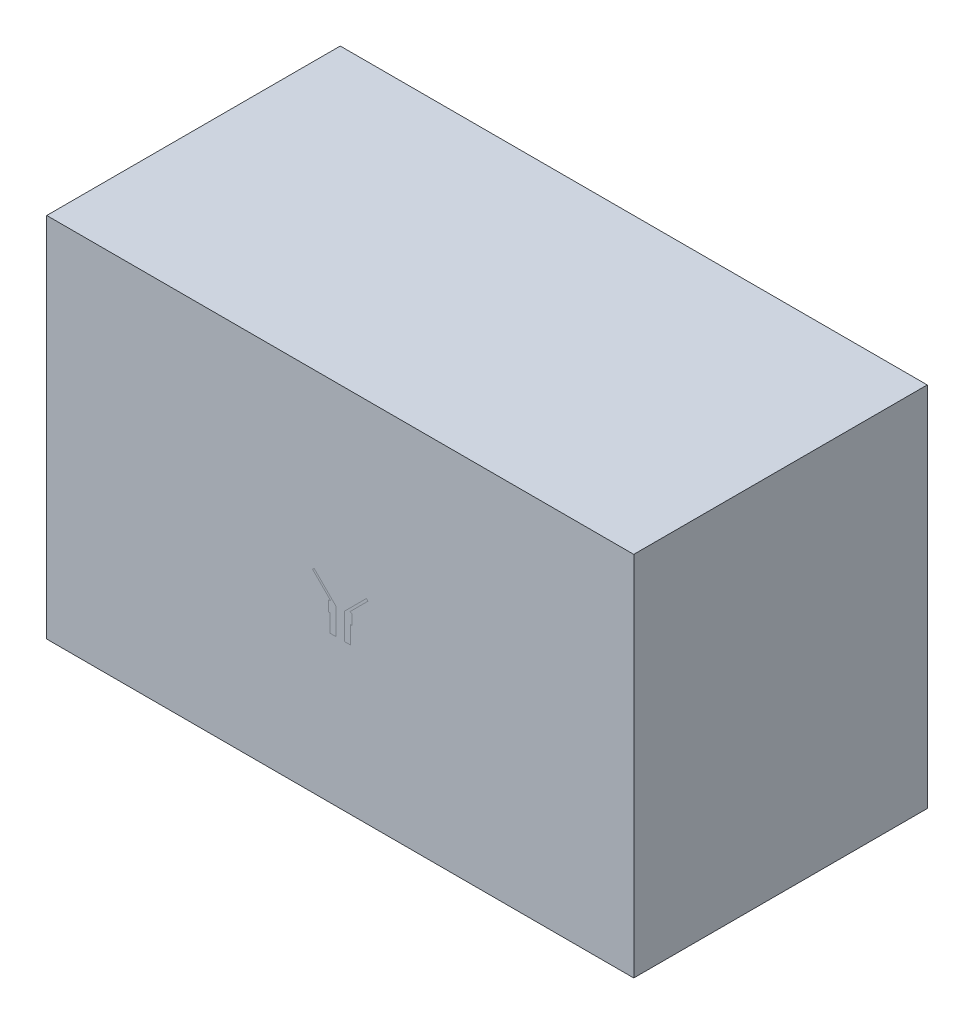
ISO-10303-21;
HEADER;
FILE_DESCRIPTION(('STEP AP214'),'2;1');
FILE_NAME('part.step','',(''),(''),'','','');
FILE_SCHEMA(('AUTOMOTIVE_DESIGN { 1 0 10303 214 1 1 1 1 }'));
ENDSEC;
DATA;
#1=APPLICATION_CONTEXT('core data for automotive mechanical design processes');
#2=APPLICATION_PROTOCOL_DEFINITION('international standard','automotive_design',2000,#1);
#3=PRODUCT_CONTEXT('',#1,'mechanical');
#4=PRODUCT('Part','Part','',(#3));
#5=PRODUCT_RELATED_PRODUCT_CATEGORY('part','',(#4));
#6=PRODUCT_DEFINITION_FORMATION('','',#4);
#7=PRODUCT_DEFINITION_CONTEXT('part definition',#1,'design');
#8=PRODUCT_DEFINITION('design','',#6,#7);
#9=PRODUCT_DEFINITION_SHAPE('','',#8);
#10=(LENGTH_UNIT() NAMED_UNIT(*) SI_UNIT(.MILLI.,.METRE.));
#11=(NAMED_UNIT(*) PLANE_ANGLE_UNIT() SI_UNIT($,.RADIAN.));
#12=(NAMED_UNIT(*) SI_UNIT($,.STERADIAN.) SOLID_ANGLE_UNIT());
#13=UNCERTAINTY_MEASURE_WITH_UNIT(LENGTH_MEASURE(1.E-05),#10,'distance_accuracy_value','');
#14=(GEOMETRIC_REPRESENTATION_CONTEXT(3) GLOBAL_UNCERTAINTY_ASSIGNED_CONTEXT((#13)) GLOBAL_UNIT_ASSIGNED_CONTEXT((#10,
#11,#12)) REPRESENTATION_CONTEXT('',''));
#15=CARTESIAN_POINT('',(0.,0.,0.));
#16=DIRECTION('',(0.,0.,1.));
#17=DIRECTION('',(1.,0.,0.));
#18=AXIS2_PLACEMENT_3D('',#15,#16,#17);
#19=CARTESIAN_POINT('',(0.,457.,0.));
#20=DIRECTION('',(0.,1.,0.));
#21=DIRECTION('',(0.,0.,1.));
#22=AXIS2_PLACEMENT_3D('',#19,#20,#21);
#23=CONICAL_SURFACE('',#22,75.,0.785398163397443);
#24=DIRECTION('',(0.707106781186544,0.707106781186551,0.));
#25=VECTOR('',#24,1.);
#26=CARTESIAN_POINT('',(0.,381.999999999999,0.));
#27=LINE('',#26,#25);
#28=CARTESIAN_POINT('',(452.170757084903,834.170757084906,0.));
#29=VERTEX_POINT('',#28);
#30=CARTESIAN_POINT('',(75.,457.,0.));
#31=VERTEX_POINT('',#30);
#32=EDGE_CURVE('E171',#29,#31,#27,.F.);
#33=ORIENTED_EDGE('',*,*,#32,.F.);
#34=CARTESIAN_POINT('',(0.,834.170757084906,0.));
#35=DIRECTION('',(0.,-1.,0.));
#36=DIRECTION('',(0.,0.,-1.));
#37=AXIS2_PLACEMENT_3D('',#34,#35,#36);
#38=CIRCLE('',#37,452.170757084903);
#39=CARTESIAN_POINT('',(-452.170757084903,834.170757084906,0.));
#40=VERTEX_POINT('',#39);
#41=EDGE_CURVE('E155',#40,#29,#38,.T.);
#42=ORIENTED_EDGE('',*,*,#41,.F.);
#43=DIRECTION('',(0.707106781186544,-0.707106781186551,0.));
#44=VECTOR('',#43,1.);
#45=CARTESIAN_POINT('',(0.,381.999999999999,0.));
#46=LINE('',#45,#44);
#47=CARTESIAN_POINT('',(-75.,457.,0.));
#48=VERTEX_POINT('',#47);
#49=EDGE_CURVE('E136',#48,#40,#46,.F.);
#50=ORIENTED_EDGE('',*,*,#49,.F.);
#51=CARTESIAN_POINT('',(0.,457.,0.));
#52=DIRECTION('',(0.,-1.,0.));
#53=DIRECTION('',(0.,0.,-1.));
#54=AXIS2_PLACEMENT_3D('',#51,#52,#53);
#55=CIRCLE('',#54,75.);
#56=EDGE_CURVE('E124',#48,#31,#55,.T.);
#57=ORIENTED_EDGE('',*,*,#56,.T.);
#58=EDGE_LOOP('',(#33,#42,#50,#57));
#59=FACE_BOUND('',#58,.T.);
#60=ADVANCED_FACE('F49',(#59),#23,.F.);
#61=CARTESIAN_POINT('',(0.,834.170757084906,0.));
#62=DIRECTION('',(0.,-1.,0.));
#63=DIRECTION('',(0.,0.,-1.));
#64=AXIS2_PLACEMENT_3D('',#61,#62,#63);
#65=CONICAL_SURFACE('',#64,452.170757084903,0.785398163397452);
#66=DIRECTION('',(-0.70710678118655,-0.707106781186545,0.));
#67=VECTOR('',#66,1.);
#68=CARTESIAN_POINT('',(0.,1286.34151416981,0.));
#69=LINE('',#68,#67);
#70=CARTESIAN_POINT('',(-479.11152544811,807.229988721699,0.));
#71=VERTEX_POINT('',#70);
#72=EDGE_CURVE('E140',#40,#71,#69,.T.);
#73=ORIENTED_EDGE('',*,*,#72,.F.);
#74=ORIENTED_EDGE('',*,*,#41,.T.);
#75=DIRECTION('',(-0.70710678118655,0.707106781186545,0.));
#76=VECTOR('',#75,1.);
#77=CARTESIAN_POINT('',(0.,1286.34151416981,0.));
#78=LINE('',#77,#76);
#79=CARTESIAN_POINT('',(479.11152544811,807.229988721699,0.));
#80=VERTEX_POINT('',#79);
#81=EDGE_CURVE('E173',#80,#29,#78,.T.);
#82=ORIENTED_EDGE('',*,*,#81,.F.);
#83=CARTESIAN_POINT('',(0.,807.229988721699,0.));
#84=DIRECTION('',(0.,-1.,0.));
#85=DIRECTION('',(0.,0.,-1.));
#86=AXIS2_PLACEMENT_3D('',#83,#84,#85);
#87=CIRCLE('',#86,479.11152544811);
#88=EDGE_CURVE('E152',#71,#80,#87,.T.);
#89=ORIENTED_EDGE('',*,*,#88,.F.);
#90=EDGE_LOOP('',(#73,#74,#82,#89));
#91=FACE_BOUND('',#90,.T.);
#92=ADVANCED_FACE('F199',(#91),#65,.T.);
#93=CARTESIAN_POINT('',(0.,807.229988721699,0.));
#94=DIRECTION('',(0.,1.,0.));
#95=DIRECTION('',(0.,0.,1.));
#96=AXIS2_PLACEMENT_3D('',#93,#94,#95);
#97=CONICAL_SURFACE('',#96,479.11152544811,0.785398163397443);
#98=DIRECTION('',(0.707106781186544,0.707106781186551,0.));
#99=VECTOR('',#98,1.);
#100=CARTESIAN_POINT('',(0.,328.118463273584,0.));
#101=LINE('',#100,#99);
#102=CARTESIAN_POINT('',(168.947894422365,497.066357695951,0.));
#103=VERTEX_POINT('',#102);
#104=EDGE_CURVE('E175',#103,#80,#101,.T.);
#105=ORIENTED_EDGE('',*,*,#104,.F.);
#106=CARTESIAN_POINT('',(0.,497.066357695951,0.));
#107=DIRECTION('',(0.,-1.,0.));
#108=DIRECTION('',(0.,0.,-1.));
#109=AXIS2_PLACEMENT_3D('',#106,#107,#108);
#110=CIRCLE('',#109,168.947894422365);
#111=CARTESIAN_POINT('',(-168.947894422365,497.066357695951,0.));
#112=VERTEX_POINT('',#111);
#113=EDGE_CURVE('E149',#112,#103,#110,.T.);
#114=ORIENTED_EDGE('',*,*,#113,.F.);
#115=DIRECTION('',(0.707106781186544,-0.707106781186551,0.));
#116=VECTOR('',#115,1.);
#117=CARTESIAN_POINT('',(0.,328.118463273584,0.));
#118=LINE('',#117,#116);
#119=EDGE_CURVE('E161',#71,#112,#118,.T.);
#120=ORIENTED_EDGE('',*,*,#119,.F.);
#121=ORIENTED_EDGE('',*,*,#88,.T.);
#122=EDGE_LOOP('',(#105,#114,#120,#121));
#123=FACE_BOUND('',#122,.T.);
#124=ADVANCED_FACE('F205',(#123),#97,.T.);
#125=CARTESIAN_POINT('',(0.,497.066357695951,0.));
#126=DIRECTION('',(0.,-1.,0.));
#127=DIRECTION('',(0.,0.,-1.));
#128=AXIS2_PLACEMENT_3D('',#125,#126,#127);
#129=CONICAL_SURFACE('',#128,168.947894422365,1.13446401379632);
#130=DIRECTION('',(-0.906307787036652,-0.422618261740694,0.));
#131=VECTOR('',#130,1.);
#132=CARTESIAN_POINT('',(0.,575.84805469426,0.));
#133=LINE('',#132,#131);
#134=CARTESIAN_POINT('',(-200.4,482.4,0.));
#135=VERTEX_POINT('',#134);
#136=EDGE_CURVE('E163',#112,#135,#133,.T.);
#137=ORIENTED_EDGE('',*,*,#136,.F.);
#138=ORIENTED_EDGE('',*,*,#113,.T.);
#139=DIRECTION('',(-0.906307787036652,0.422618261740694,0.));
#140=VECTOR('',#139,1.);
#141=CARTESIAN_POINT('',(0.,575.84805469426,0.));
#142=LINE('',#141,#140);
#143=CARTESIAN_POINT('',(200.4,482.4,0.));
#144=VERTEX_POINT('',#143);
#145=EDGE_CURVE('E177',#144,#103,#142,.T.);
#146=ORIENTED_EDGE('',*,*,#145,.F.);
#147=CARTESIAN_POINT('',(0.,482.4,0.));
#148=DIRECTION('',(0.,-1.,0.));
#149=DIRECTION('',(0.,0.,-1.));
#150=AXIS2_PLACEMENT_3D('',#147,#148,#149);
#151=CIRCLE('',#150,200.4);
#152=EDGE_CURVE('E146',#135,#144,#151,.T.);
#153=ORIENTED_EDGE('',*,*,#152,.F.);
#154=EDGE_LOOP('',(#137,#138,#146,#153));
#155=FACE_BOUND('',#154,.T.);
#156=ADVANCED_FACE('F213',(#155),#129,.T.);
#157=CARTESIAN_POINT('',(0.,0.,0.));
#158=DIRECTION('',(0.,-1.,0.));
#159=DIRECTION('',(0.,0.,-1.));
#160=AXIS2_PLACEMENT_3D('',#157,#158,#159);
#161=CYLINDRICAL_SURFACE('',#160,200.4);
#162=DIRECTION('',(0.,-1.,0.));
#163=VECTOR('',#162,1.);
#164=CARTESIAN_POINT('',(-200.4,0.,0.));
#165=LINE('',#164,#163);
#166=CARTESIAN_POINT('',(-200.4,307.,0.));
#167=VERTEX_POINT('',#166);
#168=EDGE_CURVE('E165',#135,#167,#165,.T.);
#169=ORIENTED_EDGE('',*,*,#168,.F.);
#170=ORIENTED_EDGE('',*,*,#152,.T.);
#171=DIRECTION('',(0.,-1.,0.));
#172=VECTOR('',#171,1.);
#173=CARTESIAN_POINT('',(200.4,0.,0.));
#174=LINE('',#173,#172);
#175=CARTESIAN_POINT('',(200.4,307.,0.));
#176=VERTEX_POINT('',#175);
#177=EDGE_CURVE('E131',#176,#144,#174,.F.);
#178=ORIENTED_EDGE('',*,*,#177,.F.);
#179=CARTESIAN_POINT('',(0.,307.,0.));
#180=DIRECTION('',(0.,-1.,0.));
#181=DIRECTION('',(0.,0.,-1.));
#182=AXIS2_PLACEMENT_3D('',#179,#180,#181);
#183=CIRCLE('',#182,200.4);
#184=EDGE_CURVE('E130',#167,#176,#183,.T.);
#185=ORIENTED_EDGE('',*,*,#184,.F.);
#186=EDGE_LOOP('',(#169,#170,#178,#185));
#187=FACE_BOUND('',#186,.T.);
#188=ADVANCED_FACE('F217',(#187),#161,.T.);
#189=CARTESIAN_POINT('',(-175.,307.,0.));
#190=DIRECTION('',(0.,1.,0.));
#191=DIRECTION('',(0.,0.,1.));
#192=AXIS2_PLACEMENT_3D('',#189,#190,#191);
#193=PLANE('',#192);
#194=DIRECTION('',(1.,0.,0.));
#195=VECTOR('',#194,1.);
#196=CARTESIAN_POINT('',(-175.,307.,0.));
#197=LINE('',#196,#195);
#198=CARTESIAN_POINT('',(-175.,307.,0.));
#199=VERTEX_POINT('',#198);
#200=EDGE_CURVE('E71',#167,#199,#197,.T.);
#201=ORIENTED_EDGE('',*,*,#200,.F.);
#202=ORIENTED_EDGE('',*,*,#184,.T.);
#203=CARTESIAN_POINT('',(175.,307.,0.));
#204=VERTEX_POINT('',#203);
#205=EDGE_CURVE('E118',#204,#176,#197,.T.);
#206=ORIENTED_EDGE('',*,*,#205,.F.);
#207=CARTESIAN_POINT('',(0.,307.,0.));
#208=DIRECTION('',(0.,1.,0.));
#209=DIRECTION('',(0.,0.,1.));
#210=AXIS2_PLACEMENT_3D('',#207,#208,#209);
#211=CIRCLE('',#210,175.);
#212=EDGE_CURVE('E128',#204,#199,#211,.T.);
#213=ORIENTED_EDGE('',*,*,#212,.T.);
#214=EDGE_LOOP('',(#201,#202,#206,#213));
#215=FACE_BOUND('',#214,.T.);
#216=ADVANCED_FACE('F51',(#215),#193,.F.);
#217=CARTESIAN_POINT('',(0.,457.,0.));
#218=DIRECTION('',(0.,-1.,0.));
#219=DIRECTION('',(0.,0.,-1.));
#220=AXIS2_PLACEMENT_3D('',#217,#218,#219);
#221=CYLINDRICAL_SURFACE('',#220,75.);
#222=ORIENTED_EDGE('',*,*,#56,.F.);
#223=DIRECTION('',(0.,-1.,0.));
#224=VECTOR('',#223,1.);
#225=CARTESIAN_POINT('',(-75.,457.,0.));
#226=LINE('',#225,#224);
#227=CARTESIAN_POINT('',(-75.,0.,0.));
#228=VERTEX_POINT('',#227);
#229=EDGE_CURVE('E167',#48,#228,#226,.T.);
#230=ORIENTED_EDGE('',*,*,#229,.T.);
#231=CARTESIAN_POINT('',(0.,0.,0.));
#232=DIRECTION('',(0.,1.,0.));
#233=DIRECTION('',(0.,0.,1.));
#234=AXIS2_PLACEMENT_3D('',#231,#232,#233);
#235=CIRCLE('',#234,75.);
#236=CARTESIAN_POINT('',(75.,0.,0.));
#237=VERTEX_POINT('',#236);
#238=EDGE_CURVE('E138',#237,#228,#235,.T.);
#239=ORIENTED_EDGE('',*,*,#238,.F.);
#240=DIRECTION('',(0.,-1.,0.));
#241=VECTOR('',#240,1.);
#242=CARTESIAN_POINT('',(75.,457.,0.));
#243=LINE('',#242,#241);
#244=EDGE_CURVE('E132',#237,#31,#243,.F.);
#245=ORIENTED_EDGE('',*,*,#244,.T.);
#246=EDGE_LOOP('',(#222,#230,#239,#245));
#247=FACE_BOUND('',#246,.T.);
#248=ADVANCED_FACE('F189',(#247),#221,.F.);
#249=CARTESIAN_POINT('',(0.,0.,0.));
#250=DIRECTION('',(0.,1.,0.));
#251=DIRECTION('',(0.,0.,1.));
#252=AXIS2_PLACEMENT_3D('',#249,#250,#251);
#253=PLANE('',#252);
#254=DIRECTION('',(1.,0.,0.));
#255=VECTOR('',#254,1.);
#256=CARTESIAN_POINT('',(0.,0.,0.));
#257=LINE('',#256,#255);
#258=CARTESIAN_POINT('',(-175.,0.,0.));
#259=VERTEX_POINT('',#258);
#260=EDGE_CURVE('E170',#259,#228,#257,.T.);
#261=ORIENTED_EDGE('',*,*,#260,.F.);
#262=CARTESIAN_POINT('',(0.,0.,0.));
#263=DIRECTION('',(0.,1.,0.));
#264=DIRECTION('',(0.,0.,1.));
#265=AXIS2_PLACEMENT_3D('',#262,#263,#264);
#266=CIRCLE('',#265,175.);
#267=CARTESIAN_POINT('',(175.,0.,0.));
#268=VERTEX_POINT('',#267);
#269=EDGE_CURVE('E135',#268,#259,#266,.T.);
#270=ORIENTED_EDGE('',*,*,#269,.F.);
#271=EDGE_CURVE('E64',#237,#268,#257,.T.);
#272=ORIENTED_EDGE('',*,*,#271,.F.);
#273=ORIENTED_EDGE('',*,*,#238,.T.);
#274=EDGE_LOOP('',(#261,#270,#272,#273));
#275=FACE_BOUND('',#274,.T.);
#276=ADVANCED_FACE('F190',(#275),#253,.F.);
#277=CARTESIAN_POINT('',(0.,457.,0.));
#278=DIRECTION('',(0.,-1.,0.));
#279=DIRECTION('',(0.,0.,-1.));
#280=AXIS2_PLACEMENT_3D('',#277,#278,#279);
#281=CYLINDRICAL_SURFACE('',#280,175.);
#282=DIRECTION('',(0.,-1.,0.));
#283=VECTOR('',#282,1.);
#284=CARTESIAN_POINT('',(-175.,457.,0.));
#285=LINE('',#284,#283);
#286=EDGE_CURVE('E12',#199,#259,#285,.T.);
#287=ORIENTED_EDGE('',*,*,#286,.F.);
#288=ORIENTED_EDGE('',*,*,#212,.F.);
#289=DIRECTION('',(0.,-1.,0.));
#290=VECTOR('',#289,1.);
#291=CARTESIAN_POINT('',(175.,457.,0.));
#292=LINE('',#291,#290);
#293=EDGE_CURVE('E57',#268,#204,#292,.F.);
#294=ORIENTED_EDGE('',*,*,#293,.F.);
#295=ORIENTED_EDGE('',*,*,#269,.T.);
#296=EDGE_LOOP('',(#287,#288,#294,#295));
#297=FACE_BOUND('',#296,.T.);
#298=ADVANCED_FACE('F134',(#297),#281,.T.);
#299=CARTESIAN_POINT('',(0.,0.,0.));
#300=DIRECTION('',(0.,0.,1.));
#301=DIRECTION('',(1.,0.,0.));
#302=AXIS2_PLACEMENT_3D('',#299,#300,#301);
#303=PLANE('',#302);
#304=ORIENTED_EDGE('',*,*,#32,.T.);
#305=ORIENTED_EDGE('',*,*,#244,.F.);
#306=ORIENTED_EDGE('',*,*,#271,.T.);
#307=ORIENTED_EDGE('',*,*,#293,.T.);
#308=ORIENTED_EDGE('',*,*,#205,.T.);
#309=ORIENTED_EDGE('',*,*,#177,.T.);
#310=ORIENTED_EDGE('',*,*,#145,.T.);
#311=ORIENTED_EDGE('',*,*,#104,.T.);
#312=ORIENTED_EDGE('',*,*,#81,.T.);
#313=EDGE_LOOP('',(#304,#305,#306,#307,#308,#309,#310,#311,#312));
#314=FACE_BOUND('',#313,.T.);
#315=ADVANCED_FACE('F117',(#314),#303,.T.);
#316=ORIENTED_EDGE('',*,*,#49,.T.);
#317=ORIENTED_EDGE('',*,*,#72,.T.);
#318=ORIENTED_EDGE('',*,*,#119,.T.);
#319=ORIENTED_EDGE('',*,*,#136,.T.);
#320=ORIENTED_EDGE('',*,*,#168,.T.);
#321=ORIENTED_EDGE('',*,*,#200,.T.);
#322=ORIENTED_EDGE('',*,*,#286,.T.);
#323=ORIENTED_EDGE('',*,*,#260,.T.);
#324=ORIENTED_EDGE('',*,*,#229,.F.);
#325=EDGE_LOOP('',(#316,#317,#318,#319,#320,#321,#322,#323,#324));
#326=FACE_BOUND('',#325,.T.);
#327=ADVANCED_FACE('F183',(#326),#303,.T.);
#328=CLOSED_SHELL('',(#60,#92,#124,#156,#188,#216,#248,#276,#298,#315,#327));
#329=MANIFOLD_SOLID_BREP('B2',#328);
#330=CARTESIAN_POINT('',(5080.,-2540.,5080.));
#331=DIRECTION('',(0.,1.,0.));
#332=DIRECTION('',(0.,0.,1.));
#333=AXIS2_PLACEMENT_3D('',#330,#331,#332);
#334=PLANE('',#333);
#335=DIRECTION('',(1.,0.,0.));
#336=VECTOR('',#335,1.);
#337=CARTESIAN_POINT('',(5080.,-2540.,0.));
#338=LINE('',#337,#336);
#339=CARTESIAN_POINT('',(-5080.,-2540.,0.));
#340=VERTEX_POINT('',#339);
#341=CARTESIAN_POINT('',(5080.,-2540.,0.));
#342=VERTEX_POINT('',#341);
#343=EDGE_CURVE('E481',#340,#342,#338,.T.);
#344=ORIENTED_EDGE('',*,*,#343,.F.);
#345=DIRECTION('',(0.,0.,-1.));
#346=VECTOR('',#345,1.);
#347=CARTESIAN_POINT('',(-5080.,-2540.,5080.));
#348=LINE('',#347,#346);
#349=CARTESIAN_POINT('',(-5080.,-2540.,-5080.));
#350=VERTEX_POINT('',#349);
#351=EDGE_CURVE('E466',#340,#350,#348,.T.);
#352=ORIENTED_EDGE('',*,*,#351,.T.);
#353=DIRECTION('',(-1.,0.,0.));
#354=VECTOR('',#353,1.);
#355=CARTESIAN_POINT('',(5080.,-2540.,-5080.));
#356=LINE('',#355,#354);
#357=CARTESIAN_POINT('',(5080.,-2540.,-5080.));
#358=VERTEX_POINT('',#357);
#359=EDGE_CURVE('E425',#358,#350,#356,.T.);
#360=ORIENTED_EDGE('',*,*,#359,.F.);
#361=DIRECTION('',(0.,0.,-1.));
#362=VECTOR('',#361,1.);
#363=CARTESIAN_POINT('',(5080.,-2540.,5080.));
#364=LINE('',#363,#362);
#365=EDGE_CURVE('E462',#342,#358,#364,.T.);
#366=ORIENTED_EDGE('',*,*,#365,.F.);
#367=EDGE_LOOP('',(#344,#352,#360,#366));
#368=FACE_BOUND('',#367,.T.);
#369=ADVANCED_FACE('F303',(#368),#334,.F.);
#370=CARTESIAN_POINT('',(5080.,3810.00000000001,5080.));
#371=DIRECTION('',(0.,-1.,0.));
#372=DIRECTION('',(0.,0.,-1.));
#373=AXIS2_PLACEMENT_3D('',#370,#371,#372);
#374=PLANE('',#373);
#375=DIRECTION('',(-1.,0.,0.));
#376=VECTOR('',#375,1.);
#377=CARTESIAN_POINT('',(5080.,3810.,0.));
#378=LINE('',#377,#376);
#379=CARTESIAN_POINT('',(5080.,3810.,0.));
#380=VERTEX_POINT('',#379);
#381=CARTESIAN_POINT('',(-5080.,3810.,1.77635683940025E-12));
#382=VERTEX_POINT('',#381);
#383=EDGE_CURVE('E319',#380,#382,#378,.T.);
#384=ORIENTED_EDGE('',*,*,#383,.F.);
#385=DIRECTION('',(0.,0.,1.));
#386=VECTOR('',#385,1.);
#387=CARTESIAN_POINT('',(5080.,3810.00000000001,5080.));
#388=LINE('',#387,#386);
#389=CARTESIAN_POINT('',(5080.,3810.,-5080.));
#390=VERTEX_POINT('',#389);
#391=EDGE_CURVE('E457',#390,#380,#388,.T.);
#392=ORIENTED_EDGE('',*,*,#391,.F.);
#393=DIRECTION('',(-1.,0.,0.));
#394=VECTOR('',#393,1.);
#395=CARTESIAN_POINT('',(5080.,3810.,-5080.));
#396=LINE('',#395,#394);
#397=CARTESIAN_POINT('',(-5080.,3810.,-5080.));
#398=VERTEX_POINT('',#397);
#399=EDGE_CURVE('E453',#390,#398,#396,.T.);
#400=ORIENTED_EDGE('',*,*,#399,.T.);
#401=DIRECTION('',(0.,0.,1.));
#402=VECTOR('',#401,1.);
#403=CARTESIAN_POINT('',(-5080.,3810.00000000001,5080.));
#404=LINE('',#403,#402);
#405=EDGE_CURVE('E458',#398,#382,#404,.T.);
#406=ORIENTED_EDGE('',*,*,#405,.T.);
#407=EDGE_LOOP('',(#384,#392,#400,#406));
#408=FACE_BOUND('',#407,.T.);
#409=ADVANCED_FACE('F570',(#408),#374,.F.);
#410=CARTESIAN_POINT('',(5080.,0.,0.));
#411=DIRECTION('',(1.,0.,0.));
#412=DIRECTION('',(0.,0.,-1.));
#413=AXIS2_PLACEMENT_3D('',#410,#411,#412);
#414=PLANE('',#413);
#415=ORIENTED_EDGE('',*,*,#391,.T.);
#416=DIRECTION('',(0.,-1.,0.));
#417=VECTOR('',#416,1.);
#418=CARTESIAN_POINT('',(5080.,0.,0.));
#419=LINE('',#418,#417);
#420=EDGE_CURVE('E469',#380,#342,#419,.T.);
#421=ORIENTED_EDGE('',*,*,#420,.T.);
#422=ORIENTED_EDGE('',*,*,#365,.T.);
#423=DIRECTION('',(0.,1.,0.));
#424=VECTOR('',#423,1.);
#425=CARTESIAN_POINT('',(5080.,3810.,-5080.));
#426=LINE('',#425,#424);
#427=EDGE_CURVE('E473',#358,#390,#426,.T.);
#428=ORIENTED_EDGE('',*,*,#427,.T.);
#429=EDGE_LOOP('',(#415,#421,#422,#428));
#430=FACE_BOUND('',#429,.T.);
#431=ADVANCED_FACE('F576',(#430),#414,.T.);
#432=CARTESIAN_POINT('',(-5080.,0.,0.));
#433=DIRECTION('',(1.,0.,0.));
#434=DIRECTION('',(0.,0.,-1.));
#435=AXIS2_PLACEMENT_3D('',#432,#433,#434);
#436=PLANE('',#435);
#437=DIRECTION('',(0.,-1.,0.));
#438=VECTOR('',#437,1.);
#439=CARTESIAN_POINT('',(-5080.,0.,0.));
#440=LINE('',#439,#438);
#441=EDGE_CURVE('E486',#382,#340,#440,.T.);
#442=ORIENTED_EDGE('',*,*,#441,.F.);
#443=ORIENTED_EDGE('',*,*,#405,.F.);
#444=DIRECTION('',(0.,1.,0.));
#445=VECTOR('',#444,1.);
#446=CARTESIAN_POINT('',(-5080.,3810.,-5080.));
#447=LINE('',#446,#445);
#448=EDGE_CURVE('E463',#350,#398,#447,.T.);
#449=ORIENTED_EDGE('',*,*,#448,.F.);
#450=ORIENTED_EDGE('',*,*,#351,.F.);
#451=EDGE_LOOP('',(#442,#443,#449,#450));
#452=FACE_BOUND('',#451,.T.);
#453=ADVANCED_FACE('F583',(#452),#436,.F.);
#454=CARTESIAN_POINT('',(5080.,3810.,-5080.));
#455=DIRECTION('',(0.,0.,1.));
#456=DIRECTION('',(0.,-1.,0.));
#457=AXIS2_PLACEMENT_3D('',#454,#455,#456);
#458=PLANE('',#457);
#459=ORIENTED_EDGE('',*,*,#448,.T.);
#460=ORIENTED_EDGE('',*,*,#399,.F.);
#461=ORIENTED_EDGE('',*,*,#427,.F.);
#462=ORIENTED_EDGE('',*,*,#359,.T.);
#463=EDGE_LOOP('',(#459,#460,#461,#462));
#464=FACE_BOUND('',#463,.T.);
#465=ADVANCED_FACE('F581',(#464),#458,.F.);
#466=CARTESIAN_POINT('',(0.,0.,0.));
#467=DIRECTION('',(0.,0.,1.));
#468=DIRECTION('',(1.,0.,0.));
#469=AXIS2_PLACEMENT_3D('',#466,#467,#468);
#470=PLANE('',#469);
#471=ORIENTED_EDGE('',*,*,#383,.T.);
#472=ORIENTED_EDGE('',*,*,#441,.T.);
#473=ORIENTED_EDGE('',*,*,#343,.T.);
#474=ORIENTED_EDGE('',*,*,#420,.F.);
#475=EDGE_LOOP('',(#471,#472,#473,#474));
#476=FACE_BOUND('',#475,.T.);
#477=DIRECTION('',(0.,-1.,0.));
#478=VECTOR('',#477,1.);
#479=CARTESIAN_POINT('',(-75.,457.,0.));
#480=LINE('',#479,#478);
#481=CARTESIAN_POINT('',(-75.,457.,0.));
#482=VERTEX_POINT('',#481);
#483=CARTESIAN_POINT('',(-75.,0.,0.));
#484=VERTEX_POINT('',#483);
#485=EDGE_CURVE('E510',#482,#484,#480,.T.);
#486=ORIENTED_EDGE('',*,*,#485,.T.);
#487=DIRECTION('',(1.,0.,0.));
#488=VECTOR('',#487,1.);
#489=CARTESIAN_POINT('',(0.,0.,0.));
#490=LINE('',#489,#488);
#491=CARTESIAN_POINT('',(-175.,0.,0.));
#492=VERTEX_POINT('',#491);
#493=EDGE_CURVE('E417',#492,#484,#490,.T.);
#494=ORIENTED_EDGE('',*,*,#493,.F.);
#495=DIRECTION('',(0.,-1.,0.));
#496=VECTOR('',#495,1.);
#497=CARTESIAN_POINT('',(-175.,457.,0.));
#498=LINE('',#497,#496);
#499=CARTESIAN_POINT('',(-175.,307.,0.));
#500=VERTEX_POINT('',#499);
#501=EDGE_CURVE('E47',#500,#492,#498,.T.);
#502=ORIENTED_EDGE('',*,*,#501,.F.);
#503=DIRECTION('',(1.,0.,0.));
#504=VECTOR('',#503,1.);
#505=CARTESIAN_POINT('',(-175.,307.,0.));
#506=LINE('',#505,#504);
#507=CARTESIAN_POINT('',(-200.4,307.,0.));
#508=VERTEX_POINT('',#507);
#509=EDGE_CURVE('E509',#508,#500,#506,.T.);
#510=ORIENTED_EDGE('',*,*,#509,.F.);
#511=DIRECTION('',(0.,-1.,0.));
#512=VECTOR('',#511,1.);
#513=CARTESIAN_POINT('',(-200.4,0.,0.));
#514=LINE('',#513,#512);
#515=CARTESIAN_POINT('',(-200.4,482.4,0.));
#516=VERTEX_POINT('',#515);
#517=EDGE_CURVE('E505',#516,#508,#514,.T.);
#518=ORIENTED_EDGE('',*,*,#517,.F.);
#519=DIRECTION('',(-0.906307787036652,-0.422618261740694,0.));
#520=VECTOR('',#519,1.);
#521=CARTESIAN_POINT('',(0.,575.84805469426,0.));
#522=LINE('',#521,#520);
#523=CARTESIAN_POINT('',(-168.947894422365,497.066357695951,0.));
#524=VERTEX_POINT('',#523);
#525=EDGE_CURVE('E501',#524,#516,#522,.T.);
#526=ORIENTED_EDGE('',*,*,#525,.F.);
#527=DIRECTION('',(0.707106781186544,-0.707106781186551,0.));
#528=VECTOR('',#527,1.);
#529=CARTESIAN_POINT('',(0.,328.118463273584,0.));
#530=LINE('',#529,#528);
#531=CARTESIAN_POINT('',(-479.11152544811,807.229988721699,0.));
#532=VERTEX_POINT('',#531);
#533=EDGE_CURVE('E497',#532,#524,#530,.T.);
#534=ORIENTED_EDGE('',*,*,#533,.F.);
#535=DIRECTION('',(-0.70710678118655,-0.707106781186545,0.));
#536=VECTOR('',#535,1.);
#537=CARTESIAN_POINT('',(0.,1286.34151416981,0.));
#538=LINE('',#537,#536);
#539=CARTESIAN_POINT('',(-452.170757084903,834.170757084906,0.));
#540=VERTEX_POINT('',#539);
#541=EDGE_CURVE('E493',#540,#532,#538,.T.);
#542=ORIENTED_EDGE('',*,*,#541,.F.);
#543=DIRECTION('',(0.707106781186544,-0.707106781186551,0.));
#544=VECTOR('',#543,1.);
#545=CARTESIAN_POINT('',(0.,381.999999999999,0.));
#546=LINE('',#545,#544);
#547=EDGE_CURVE('E489',#482,#540,#546,.F.);
#548=ORIENTED_EDGE('',*,*,#547,.F.);
#549=EDGE_LOOP('',(#486,#494,#502,#510,#518,#526,#534,#542,#548));
#550=FACE_BOUND('',#549,.T.);
#551=DIRECTION('',(-0.70710678118655,0.707106781186545,0.));
#552=VECTOR('',#551,1.);
#553=CARTESIAN_POINT('',(0.,1286.34151416981,0.));
#554=LINE('',#553,#552);
#555=CARTESIAN_POINT('',(479.11152544811,807.229988721699,0.));
#556=VERTEX_POINT('',#555);
#557=CARTESIAN_POINT('',(452.170757084903,834.170757084906,0.));
#558=VERTEX_POINT('',#557);
#559=EDGE_CURVE('E517',#556,#558,#554,.T.);
#560=ORIENTED_EDGE('',*,*,#559,.F.);
#561=DIRECTION('',(0.707106781186544,0.707106781186551,0.));
#562=VECTOR('',#561,1.);
#563=CARTESIAN_POINT('',(0.,328.118463273584,0.));
#564=LINE('',#563,#562);
#565=CARTESIAN_POINT('',(168.947894422365,497.066357695951,0.));
#566=VERTEX_POINT('',#565);
#567=EDGE_CURVE('E521',#566,#556,#564,.T.);
#568=ORIENTED_EDGE('',*,*,#567,.F.);
#569=DIRECTION('',(-0.906307787036652,0.422618261740694,0.));
#570=VECTOR('',#569,1.);
#571=CARTESIAN_POINT('',(0.,575.84805469426,0.));
#572=LINE('',#571,#570);
#573=CARTESIAN_POINT('',(200.4,482.4,0.));
#574=VERTEX_POINT('',#573);
#575=EDGE_CURVE('E525',#574,#566,#572,.T.);
#576=ORIENTED_EDGE('',*,*,#575,.F.);
#577=DIRECTION('',(0.,-1.,0.));
#578=VECTOR('',#577,1.);
#579=CARTESIAN_POINT('',(200.4,0.,0.));
#580=LINE('',#579,#578);
#581=CARTESIAN_POINT('',(200.4,307.,0.));
#582=VERTEX_POINT('',#581);
#583=EDGE_CURVE('E529',#582,#574,#580,.F.);
#584=ORIENTED_EDGE('',*,*,#583,.F.);
#585=CARTESIAN_POINT('',(175.,307.,0.));
#586=VERTEX_POINT('',#585);
#587=EDGE_CURVE('E327',#586,#582,#506,.T.);
#588=ORIENTED_EDGE('',*,*,#587,.F.);
#589=DIRECTION('',(0.,-1.,0.));
#590=VECTOR('',#589,1.);
#591=CARTESIAN_POINT('',(175.,457.,0.));
#592=LINE('',#591,#590);
#593=CARTESIAN_POINT('',(175.,0.,0.));
#594=VERTEX_POINT('',#593);
#595=EDGE_CURVE('E312',#594,#586,#592,.F.);
#596=ORIENTED_EDGE('',*,*,#595,.F.);
#597=CARTESIAN_POINT('',(75.,0.,0.));
#598=VERTEX_POINT('',#597);
#599=EDGE_CURVE('E398',#598,#594,#490,.T.);
#600=ORIENTED_EDGE('',*,*,#599,.F.);
#601=DIRECTION('',(0.,-1.,0.));
#602=VECTOR('',#601,1.);
#603=CARTESIAN_POINT('',(75.,457.,0.));
#604=LINE('',#603,#602);
#605=CARTESIAN_POINT('',(75.,457.,0.));
#606=VERTEX_POINT('',#605);
#607=EDGE_CURVE('E415',#598,#606,#604,.F.);
#608=ORIENTED_EDGE('',*,*,#607,.T.);
#609=DIRECTION('',(0.707106781186544,0.707106781186551,0.));
#610=VECTOR('',#609,1.);
#611=CARTESIAN_POINT('',(0.,381.999999999999,0.));
#612=LINE('',#611,#610);
#613=EDGE_CURVE('E513',#558,#606,#612,.F.);
#614=ORIENTED_EDGE('',*,*,#613,.F.);
#615=EDGE_LOOP('',(#560,#568,#576,#584,#588,#596,#600,#608,#614));
#616=FACE_BOUND('',#615,.T.);
#617=ADVANCED_FACE('F397',(#476,#550,#616),#470,.T.);
#618=CARTESIAN_POINT('',(0.,457.,0.));
#619=DIRECTION('',(0.,1.,0.));
#620=DIRECTION('',(0.,0.,1.));
#621=AXIS2_PLACEMENT_3D('',#618,#619,#620);
#622=CONICAL_SURFACE('',#621,75.,0.785398163397443);
#623=CARTESIAN_POINT('',(0.,834.170757084906,0.));
#624=DIRECTION('',(0.,-1.,0.));
#625=DIRECTION('',(0.,0.,-1.));
#626=AXIS2_PLACEMENT_3D('',#623,#624,#625);
#627=CIRCLE('',#626,452.170757084903);
#628=EDGE_CURVE('E443',#540,#558,#627,.T.);
#629=ORIENTED_EDGE('',*,*,#628,.T.);
#630=ORIENTED_EDGE('',*,*,#613,.T.);
#631=CARTESIAN_POINT('',(0.,457.,0.));
#632=DIRECTION('',(0.,-1.,0.));
#633=DIRECTION('',(0.,0.,-1.));
#634=AXIS2_PLACEMENT_3D('',#631,#632,#633);
#635=CIRCLE('',#634,75.);
#636=EDGE_CURVE('E405',#482,#606,#635,.T.);
#637=ORIENTED_EDGE('',*,*,#636,.F.);
#638=ORIENTED_EDGE('',*,*,#547,.T.);
#639=EDGE_LOOP('',(#629,#630,#637,#638));
#640=FACE_BOUND('',#639,.T.);
#641=ADVANCED_FACE('F539',(#640),#622,.T.);
#642=CARTESIAN_POINT('',(0.,834.170757084906,0.));
#643=DIRECTION('',(0.,-1.,0.));
#644=DIRECTION('',(0.,0.,-1.));
#645=AXIS2_PLACEMENT_3D('',#642,#643,#644);
#646=CONICAL_SURFACE('',#645,452.170757084903,0.785398163397452);
#647=ORIENTED_EDGE('',*,*,#628,.F.);
#648=ORIENTED_EDGE('',*,*,#541,.T.);
#649=CARTESIAN_POINT('',(0.,807.229988721699,0.));
#650=DIRECTION('',(0.,-1.,0.));
#651=DIRECTION('',(0.,0.,-1.));
#652=AXIS2_PLACEMENT_3D('',#649,#650,#651);
#653=CIRCLE('',#652,479.11152544811);
#654=EDGE_CURVE('E439',#532,#556,#653,.T.);
#655=ORIENTED_EDGE('',*,*,#654,.T.);
#656=ORIENTED_EDGE('',*,*,#559,.T.);
#657=EDGE_LOOP('',(#647,#648,#655,#656));
#658=FACE_BOUND('',#657,.T.);
#659=ADVANCED_FACE('F560',(#658),#646,.F.);
#660=CARTESIAN_POINT('',(0.,807.229988721699,0.));
#661=DIRECTION('',(0.,1.,0.));
#662=DIRECTION('',(0.,0.,1.));
#663=AXIS2_PLACEMENT_3D('',#660,#661,#662);
#664=CONICAL_SURFACE('',#663,479.11152544811,0.785398163397443);
#665=CARTESIAN_POINT('',(0.,497.066357695951,0.));
#666=DIRECTION('',(0.,-1.,0.));
#667=DIRECTION('',(0.,0.,-1.));
#668=AXIS2_PLACEMENT_3D('',#665,#666,#667);
#669=CIRCLE('',#668,168.947894422365);
#670=EDGE_CURVE('E435',#524,#566,#669,.T.);
#671=ORIENTED_EDGE('',*,*,#670,.T.);
#672=ORIENTED_EDGE('',*,*,#567,.T.);
#673=ORIENTED_EDGE('',*,*,#654,.F.);
#674=ORIENTED_EDGE('',*,*,#533,.T.);
#675=EDGE_LOOP('',(#671,#672,#673,#674));
#676=FACE_BOUND('',#675,.T.);
#677=ADVANCED_FACE('F558',(#676),#664,.F.);
#678=CARTESIAN_POINT('',(0.,497.066357695951,0.));
#679=DIRECTION('',(0.,-1.,0.));
#680=DIRECTION('',(0.,0.,-1.));
#681=AXIS2_PLACEMENT_3D('',#678,#679,#680);
#682=CONICAL_SURFACE('',#681,168.947894422365,1.13446401379632);
#683=ORIENTED_EDGE('',*,*,#670,.F.);
#684=ORIENTED_EDGE('',*,*,#525,.T.);
#685=CARTESIAN_POINT('',(0.,482.4,0.));
#686=DIRECTION('',(0.,-1.,0.));
#687=DIRECTION('',(0.,0.,-1.));
#688=AXIS2_PLACEMENT_3D('',#685,#686,#687);
#689=CIRCLE('',#688,200.4);
#690=EDGE_CURVE('E431',#516,#574,#689,.T.);
#691=ORIENTED_EDGE('',*,*,#690,.T.);
#692=ORIENTED_EDGE('',*,*,#575,.T.);
#693=EDGE_LOOP('',(#683,#684,#691,#692));
#694=FACE_BOUND('',#693,.T.);
#695=ADVANCED_FACE('F555',(#694),#682,.F.);
#696=CARTESIAN_POINT('',(0.,0.,0.));
#697=DIRECTION('',(0.,-1.,0.));
#698=DIRECTION('',(0.,0.,-1.));
#699=AXIS2_PLACEMENT_3D('',#696,#697,#698);
#700=CYLINDRICAL_SURFACE('',#699,200.4);
#701=ORIENTED_EDGE('',*,*,#690,.F.);
#702=ORIENTED_EDGE('',*,*,#517,.T.);
#703=CARTESIAN_POINT('',(0.,307.,0.));
#704=DIRECTION('',(0.,-1.,0.));
#705=DIRECTION('',(0.,0.,-1.));
#706=AXIS2_PLACEMENT_3D('',#703,#704,#705);
#707=CIRCLE('',#706,200.4);
#708=EDGE_CURVE('E423',#508,#582,#707,.T.);
#709=ORIENTED_EDGE('',*,*,#708,.T.);
#710=ORIENTED_EDGE('',*,*,#583,.T.);
#711=EDGE_LOOP('',(#701,#702,#709,#710));
#712=FACE_BOUND('',#711,.T.);
#713=ADVANCED_FACE('F552',(#712),#700,.F.);
#714=CARTESIAN_POINT('',(-175.,307.,0.));
#715=DIRECTION('',(0.,1.,0.));
#716=DIRECTION('',(0.,0.,1.));
#717=AXIS2_PLACEMENT_3D('',#714,#715,#716);
#718=PLANE('',#717);
#719=ORIENTED_EDGE('',*,*,#708,.F.);
#720=ORIENTED_EDGE('',*,*,#509,.T.);
#721=CARTESIAN_POINT('',(0.,307.,0.));
#722=DIRECTION('',(0.,1.,0.));
#723=DIRECTION('',(0.,0.,1.));
#724=AXIS2_PLACEMENT_3D('',#721,#722,#723);
#725=CIRCLE('',#724,175.);
#726=EDGE_CURVE('E419',#586,#500,#725,.T.);
#727=ORIENTED_EDGE('',*,*,#726,.F.);
#728=ORIENTED_EDGE('',*,*,#587,.T.);
#729=EDGE_LOOP('',(#719,#720,#727,#728));
#730=FACE_BOUND('',#729,.T.);
#731=ADVANCED_FACE('F549',(#730),#718,.T.);
#732=CARTESIAN_POINT('',(0.,457.,0.));
#733=DIRECTION('',(0.,-1.,0.));
#734=DIRECTION('',(0.,0.,-1.));
#735=AXIS2_PLACEMENT_3D('',#732,#733,#734);
#736=CYLINDRICAL_SURFACE('',#735,75.);
#737=ORIENTED_EDGE('',*,*,#485,.F.);
#738=ORIENTED_EDGE('',*,*,#636,.T.);
#739=ORIENTED_EDGE('',*,*,#607,.F.);
#740=CARTESIAN_POINT('',(0.,0.,0.));
#741=DIRECTION('',(0.,1.,0.));
#742=DIRECTION('',(0.,0.,1.));
#743=AXIS2_PLACEMENT_3D('',#740,#741,#742);
#744=CIRCLE('',#743,75.);
#745=EDGE_CURVE('E413',#598,#484,#744,.T.);
#746=ORIENTED_EDGE('',*,*,#745,.T.);
#747=EDGE_LOOP('',(#737,#738,#739,#746));
#748=FACE_BOUND('',#747,.T.);
#749=ADVANCED_FACE('F542',(#748),#736,.T.);
#750=CARTESIAN_POINT('',(0.,0.,0.));
#751=DIRECTION('',(0.,1.,0.));
#752=DIRECTION('',(0.,0.,1.));
#753=AXIS2_PLACEMENT_3D('',#750,#751,#752);
#754=PLANE('',#753);
#755=CARTESIAN_POINT('',(0.,0.,0.));
#756=DIRECTION('',(0.,1.,0.));
#757=DIRECTION('',(0.,0.,1.));
#758=AXIS2_PLACEMENT_3D('',#755,#756,#757);
#759=CIRCLE('',#758,175.);
#760=EDGE_CURVE('E411',#594,#492,#759,.T.);
#761=ORIENTED_EDGE('',*,*,#760,.T.);
#762=ORIENTED_EDGE('',*,*,#493,.T.);
#763=ORIENTED_EDGE('',*,*,#745,.F.);
#764=ORIENTED_EDGE('',*,*,#599,.T.);
#765=EDGE_LOOP('',(#761,#762,#763,#764));
#766=FACE_BOUND('',#765,.T.);
#767=ADVANCED_FACE('F409',(#766),#754,.T.);
#768=CARTESIAN_POINT('',(0.,457.,0.));
#769=DIRECTION('',(0.,-1.,0.));
#770=DIRECTION('',(0.,0.,-1.));
#771=AXIS2_PLACEMENT_3D('',#768,#769,#770);
#772=CYLINDRICAL_SURFACE('',#771,175.);
#773=ORIENTED_EDGE('',*,*,#726,.T.);
#774=ORIENTED_EDGE('',*,*,#501,.T.);
#775=ORIENTED_EDGE('',*,*,#760,.F.);
#776=ORIENTED_EDGE('',*,*,#595,.T.);
#777=EDGE_LOOP('',(#773,#774,#775,#776));
#778=FACE_BOUND('',#777,.T.);
#779=ADVANCED_FACE('F305',(#778),#772,.F.);
#780=CLOSED_SHELL('',(#369,#409,#431,#453,#465,#617,#641,#659,#677,#695,#713,#731,#749,#767,#779));
#781=MANIFOLD_SOLID_BREP('B6',#780);
#782=ADVANCED_BREP_SHAPE_REPRESENTATION('',(#18,#329,#781),#14);
#783=SHAPE_DEFINITION_REPRESENTATION(#9,#782);
ENDSEC;
END-ISO-10303-21;
